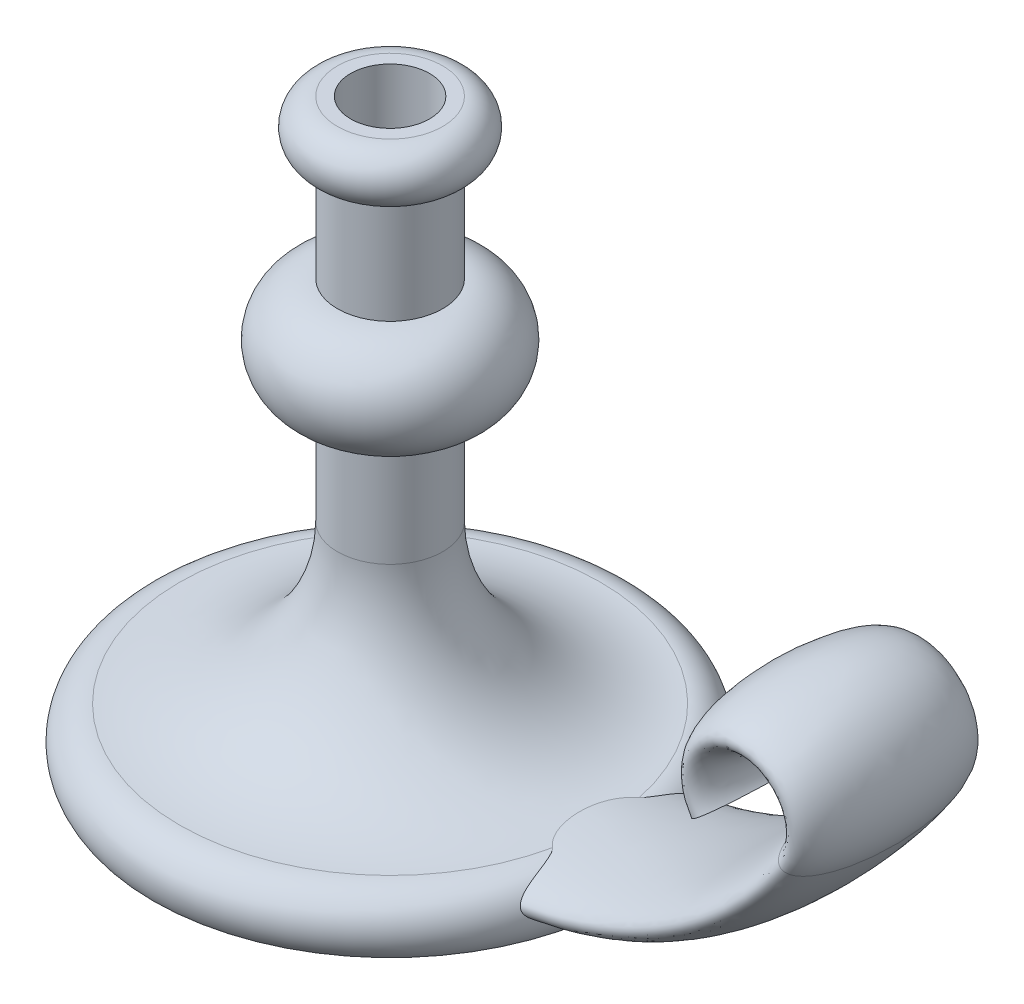
ISO-10303-21;
HEADER;
FILE_DESCRIPTION(('STEP AP214'),'2;1');
FILE_NAME('part.step','',(''),(''),'','','');
FILE_SCHEMA(('AUTOMOTIVE_DESIGN { 1 0 10303 214 1 1 1 1 }'));
ENDSEC;
DATA;
#1=APPLICATION_CONTEXT('core data for automotive mechanical design processes');
#2=APPLICATION_PROTOCOL_DEFINITION('international standard','automotive_design',2000,#1);
#3=PRODUCT_CONTEXT('',#1,'mechanical');
#4=PRODUCT('Part','Part','',(#3));
#5=PRODUCT_RELATED_PRODUCT_CATEGORY('part','',(#4));
#6=PRODUCT_DEFINITION_FORMATION('','',#4);
#7=PRODUCT_DEFINITION_CONTEXT('part definition',#1,'design');
#8=PRODUCT_DEFINITION('design','',#6,#7);
#9=PRODUCT_DEFINITION_SHAPE('','',#8);
#10=(LENGTH_UNIT() NAMED_UNIT(*) SI_UNIT(.MILLI.,.METRE.));
#11=(NAMED_UNIT(*) PLANE_ANGLE_UNIT() SI_UNIT($,.RADIAN.));
#12=(NAMED_UNIT(*) SI_UNIT($,.STERADIAN.) SOLID_ANGLE_UNIT());
#13=UNCERTAINTY_MEASURE_WITH_UNIT(LENGTH_MEASURE(1.E-05),#10,'distance_accuracy_value','');
#14=(GEOMETRIC_REPRESENTATION_CONTEXT(3) GLOBAL_UNCERTAINTY_ASSIGNED_CONTEXT((#13)) GLOBAL_UNIT_ASSIGNED_CONTEXT((#10,
#11,#12)) REPRESENTATION_CONTEXT('',''));
#15=CARTESIAN_POINT('',(0.,0.,0.));
#16=DIRECTION('',(0.,0.,1.));
#17=DIRECTION('',(1.,0.,0.));
#18=AXIS2_PLACEMENT_3D('',#15,#16,#17);
#19=CARTESIAN_POINT('',(0.,127.495412844037,0.));
#20=DIRECTION('',(0.,-1.,0.));
#21=DIRECTION('',(0.,0.,-1.));
#22=AXIS2_PLACEMENT_3D('',#19,#20,#21);
#23=PLANE('',#22);
#24=CARTESIAN_POINT('',(0.,127.495412844037,0.));
#25=DIRECTION('',(0.,1.,0.));
#26=DIRECTION('',(0.,0.,1.));
#27=AXIS2_PLACEMENT_3D('',#24,#25,#26);
#28=CIRCLE('',#27,15.);
#29=CARTESIAN_POINT('',(0.,127.495412844037,15.));
#30=VERTEX_POINT('',#29);
#31=EDGE_CURVE('E169',#30,#30,#28,.T.);
#32=ORIENTED_EDGE('',*,*,#31,.F.);
#33=EDGE_LOOP('',(#32));
#34=FACE_BOUND('',#33,.T.);
#35=CARTESIAN_POINT('',(0.,127.495412844037,0.));
#36=DIRECTION('',(0.,1.,0.));
#37=DIRECTION('',(0.,0.,1.));
#38=AXIS2_PLACEMENT_3D('',#35,#36,#37);
#39=CIRCLE('',#38,20.);
#40=CARTESIAN_POINT('',(0.,127.495412844037,20.));
#41=VERTEX_POINT('',#40);
#42=EDGE_CURVE('E69',#41,#41,#39,.T.);
#43=ORIENTED_EDGE('',*,*,#42,.T.);
#44=EDGE_LOOP('',(#43));
#45=FACE_BOUND('',#44,.T.);
#46=ADVANCED_FACE('F39',(#34,#45),#23,.F.);
#47=CARTESIAN_POINT('',(0.,-92.5045871559633,0.));
#48=DIRECTION('',(0.,1.,0.));
#49=DIRECTION('',(0.,0.,1.));
#50=AXIS2_PLACEMENT_3D('',#47,#48,#49);
#51=PLANE('',#50);
#52=CARTESIAN_POINT('',(0.,-92.5045871559633,0.));
#53=DIRECTION('',(0.,1.,0.));
#54=DIRECTION('',(0.,0.,1.));
#55=AXIS2_PLACEMENT_3D('',#52,#53,#54);
#56=CIRCLE('',#55,90.);
#57=CARTESIAN_POINT('',(0.,-92.5045871559633,90.));
#58=VERTEX_POINT('',#57);
#59=EDGE_CURVE('E53',#58,#58,#56,.T.);
#60=ORIENTED_EDGE('',*,*,#59,.F.);
#61=EDGE_LOOP('',(#60));
#62=FACE_BOUND('',#61,.T.);
#63=ADVANCED_FACE('F156',(#62),#51,.F.);
#64=CARTESIAN_POINT('',(0.,-85.0045871559633,0.));
#65=DIRECTION('',(0.,1.,0.));
#66=DIRECTION('',(0.,0.,1.));
#67=AXIS2_PLACEMENT_3D('',#64,#65,#66);
#68=TOROIDAL_SURFACE('',#67,80.0000000000001,12.5);
#69=CARTESIAN_POINT('',(0.,-72.5045871559634,0.));
#70=DIRECTION('',(0.,1.,0.));
#71=DIRECTION('',(0.,0.,1.));
#72=AXIS2_PLACEMENT_3D('',#69,#70,#71);
#73=CIRCLE('',#72,80.0000000000001);
#74=CARTESIAN_POINT('',(78.2712666342527,-72.5045871559634,-16.5411250968526));
#75=VERTEX_POINT('',#74);
#76=CARTESIAN_POINT('',(78.2712666342527,-72.5045871559633,16.5411250968526));
#77=VERTEX_POINT('',#76);
#78=EDGE_CURVE('E67',#75,#77,#73,.T.);
#79=ORIENTED_EDGE('',*,*,#78,.F.);
#80=CARTESIAN_POINT('',(78.2712666342527,-72.5045871559634,-16.5411250968528));
#81=CARTESIAN_POINT('',(78.3388892558145,-72.5045915093542,-16.5982789763076));
#82=CARTESIAN_POINT('',(78.4041967419212,-72.5053168747687,-16.658052603687));
#83=CARTESIAN_POINT('',(78.5301905551008,-72.5080437057157,-16.7815005380896));
#84=CARTESIAN_POINT('',(78.5909036085792,-72.5100370335412,-16.8451476466387));
#85=CARTESIAN_POINT('',(78.7084157352926,-72.5151314153452,-16.9755868199613));
#86=CARTESIAN_POINT('',(78.7652244379591,-72.5182296181446,-17.0423704092737));
#87=CARTESIAN_POINT('',(78.8754713552141,-72.5254114471429,-17.1785504647034));
#88=CARTESIAN_POINT('',(78.9289111406247,-72.5294946097344,-17.2479456886277));
#89=CARTESIAN_POINT('',(79.0321115032715,-72.5384856727747,-17.3879176791534));
#90=CARTESIAN_POINT('',(79.0819119096475,-72.5433817371829,-17.4584659850292));
#91=CARTESIAN_POINT('',(79.1789781802895,-72.5539641009125,-17.6013445037529));
#92=CARTESIAN_POINT('',(79.2262409589312,-72.5596513333858,-17.6736767365563));
#93=CARTESIAN_POINT('',(79.3184819734827,-72.5717535360463,-17.8198159167501));
#94=CARTESIAN_POINT('',(79.3634579992453,-72.5781691915992,-17.8936241982493));
#95=CARTESIAN_POINT('',(79.4513243361356,-72.5916739520405,-18.0424380596047));
#96=CARTESIAN_POINT('',(79.494214001074,-72.5987632635914,-18.1174440009669));
#97=CARTESIAN_POINT('',(79.5969639005976,-72.6169008060476,-18.3024023173175));
#98=CARTESIAN_POINT('',(79.6557814122336,-72.6282956005435,-18.4129004302327));
#99=CARTESIAN_POINT('',(79.7699561152132,-72.652306377049,-18.6355447229261));
#100=CARTESIAN_POINT('',(79.8253128778175,-72.6649225098742,-18.7476911047851));
#101=CARTESIAN_POINT('',(79.9868575610249,-72.7044878378632,-19.0861255774941));
#102=CARTESIAN_POINT('',(80.0885069377543,-72.7331516073427,-19.3143851937635));
#103=CARTESIAN_POINT('',(80.2823234076468,-72.794666408707,-19.7745296532846));
#104=CARTESIAN_POINT('',(80.3744817235505,-72.8275212547242,-20.0064176277774));
#105=CARTESIAN_POINT('',(80.5510014173376,-72.8971909714651,-20.4725897597494));
#106=CARTESIAN_POINT('',(80.6353613618328,-72.9340065675187,-20.7068743489863));
#107=CARTESIAN_POINT('',(80.7988648321056,-73.0121091962668,-21.1808226178135));
#108=CARTESIAN_POINT('',(80.8779027569703,-73.0534585723396,-21.4205122399656));
#109=CARTESIAN_POINT('',(81.0302064685401,-73.1400674466439,-21.9007816336799));
#110=CARTESIAN_POINT('',(81.1034770233062,-73.1853236486717,-22.1413604940642));
#111=CARTESIAN_POINT('',(81.245084590126,-73.2797924462324,-22.6230858246512));
#112=CARTESIAN_POINT('',(81.3134234622618,-73.3290035351418,-22.8642320450506));
#113=CARTESIAN_POINT('',(81.4458238857681,-73.4314781374148,-23.3468072083799));
#114=CARTESIAN_POINT('',(81.5098858231541,-73.4847412841283,-23.5882361237883));
#115=CARTESIAN_POINT('',(81.6739902059516,-73.63080179208,-24.2252806791802));
#116=CARTESIAN_POINT('',(81.7708857569272,-73.7271251131906,-24.6209063739885));
#117=CARTESIAN_POINT('',(81.9565801857021,-73.9318568212676,-25.4110697993072));
#118=CARTESIAN_POINT('',(82.0453762866304,-74.0402693248706,-25.8056071120463));
#119=CARTESIAN_POINT('',(82.2165010773454,-74.2703940534814,-26.5924524360119));
#120=CARTESIAN_POINT('',(82.2988262672455,-74.3921133917496,-26.9847591358134));
#121=CARTESIAN_POINT('',(82.4582025946178,-74.6499211224395,-27.7640097670044));
#122=CARTESIAN_POINT('',(82.5352725062751,-74.7859534127945,-28.1509683717236));
#123=CARTESIAN_POINT('',(82.6860711061443,-75.0748594050495,-28.9190701407598));
#124=CARTESIAN_POINT('',(82.7598013253312,-75.2277252775689,-29.3002159155246));
#125=CARTESIAN_POINT('',(82.8693425578225,-75.4718627823006,-29.8655437914771));
#126=CARTESIAN_POINT('',(82.9056681071528,-75.5556831811369,-30.0528569335828));
#127=CARTESIAN_POINT('',(82.9782782201637,-75.7287773077546,-30.424948369034));
#128=CARTESIAN_POINT('',(83.01456278664,-75.8180506373961,-30.6097268462419));
#129=CARTESIAN_POINT('',(83.0878356650458,-76.0036374146297,-30.9782160348205));
#130=CARTESIAN_POINT('',(83.1248273272171,-76.1000175296162,-31.1618926140779));
#131=CARTESIAN_POINT('',(83.1995540762818,-76.299666217612,-31.5253763426663));
#132=CARTESIAN_POINT('',(83.2372893138777,-76.4029361973399,-31.7051826918314));
#133=CARTESIAN_POINT('',(83.3140534809666,-76.617304704803,-32.0600551683962));
#134=CARTESIAN_POINT('',(83.3530836346586,-76.7284107592087,-32.2351165084858));
#135=CARTESIAN_POINT('',(83.4327849251538,-76.9586226280257,-32.5777969560054));
#136=CARTESIAN_POINT('',(83.4734433415735,-77.0776699716771,-32.7454580059901));
#137=CARTESIAN_POINT('',(83.5574066404026,-77.3255127934576,-33.0725591680993));
#138=CARTESIAN_POINT('',(83.6007094652056,-77.4543007106258,-33.2320054983626));
#139=CARTESIAN_POINT('',(83.6909243975622,-77.722883154956,-33.5399418459594));
#140=CARTESIAN_POINT('',(83.7378303017219,-77.8626587739595,-33.6884498686637));
#141=CARTESIAN_POINT('',(83.8124496637282,-78.0834995200816,-33.9019997501053));
#142=CARTESIAN_POINT('',(83.8383724448071,-78.1599688857172,-33.9724386291885));
#143=CARTESIAN_POINT('',(83.8916881128024,-78.3163650775124,-34.1088010547378));
#144=CARTESIAN_POINT('',(83.919080971809,-78.3962918380266,-34.1747246868735));
#145=CARTESIAN_POINT('',(83.9755475940192,-78.5597817473862,-34.3013061270112));
#146=CARTESIAN_POINT('',(84.0046227760621,-78.6433479505369,-34.3619593789756));
#147=CARTESIAN_POINT('',(84.0646175310657,-78.8140854809886,-34.4769964730707));
#148=CARTESIAN_POINT('',(84.0955371541358,-78.9012569062155,-34.5313801447535));
#149=CARTESIAN_POINT('',(84.1598279810826,-79.0803525767541,-34.6335257231657));
#150=CARTESIAN_POINT('',(84.1932276298659,-79.1723265422152,-34.681183323174));
#151=CARTESIAN_POINT('',(84.2621790731583,-79.359523994878,-34.7677396326691));
#152=CARTESIAN_POINT('',(84.2977301667913,-79.4547464194657,-34.806641175334));
#153=CARTESIAN_POINT('',(84.3709274331638,-79.6476861330435,-34.8744514195948));
#154=CARTESIAN_POINT('',(84.4085691399329,-79.7453978795024,-34.9033805380393));
#155=CARTESIAN_POINT('',(84.4858897292481,-79.9426247340496,-34.9503388268915));
#156=CARTESIAN_POINT('',(84.5255682091119,-80.0421394831753,-34.9683701429243));
#157=CARTESIAN_POINT('',(84.6022970376678,-80.2310279556876,-34.9915485155604));
#158=CARTESIAN_POINT('',(84.6391657268353,-80.3203310292361,-34.997880805206));
#159=CARTESIAN_POINT('',(84.7140458891139,-80.4986252705471,-35.0012194091044));
#160=CARTESIAN_POINT('',(84.7520572593239,-80.5876164655939,-34.9982265606315));
#161=CARTESIAN_POINT('',(84.828939751449,-80.7645113433256,-34.9830935336921));
#162=CARTESIAN_POINT('',(84.8678114880931,-80.8524141735395,-34.9709465954878));
#163=CARTESIAN_POINT('',(84.946069114117,-81.0263395954697,-34.9379800584416));
#164=CARTESIAN_POINT('',(84.9854550697223,-81.1123619411083,-34.9171593316254));
#165=CARTESIAN_POINT('',(85.0697921876547,-81.2934408710784,-34.8641753280259));
#166=CARTESIAN_POINT('',(85.1147749779847,-81.388144099751,-34.8308581676941));
#167=CARTESIAN_POINT('',(85.2046838445247,-81.5739050292824,-34.7550998186569));
#168=CARTESIAN_POINT('',(85.2496098599892,-81.6649601634005,-34.7126523352378));
#169=CARTESIAN_POINT('',(85.339175816421,-81.8432389012871,-34.6197961730878));
#170=CARTESIAN_POINT('',(85.3838152384236,-81.9304566626695,-34.5693758577485));
#171=CARTESIAN_POINT('',(85.4725433576223,-82.1008448335008,-34.4617763413088));
#172=CARTESIAN_POINT('',(85.5166321604852,-82.1840160286621,-34.4045984597628));
#173=CARTESIAN_POINT('',(85.6333169412866,-82.4005453206436,-34.244469560309));
#174=CARTESIAN_POINT('',(85.7053409594005,-82.5304330306689,-34.1363971219682));
#175=CARTESIAN_POINT('',(85.8473354366557,-82.7802199016686,-33.9080434887014));
#176=CARTESIAN_POINT('',(85.9173043345906,-82.9001115899402,-33.7877533065824));
#177=CARTESIAN_POINT('',(86.0552514115732,-83.1311555673389,-33.5375399276813));
#178=CARTESIAN_POINT('',(86.1232253856288,-83.2422901268753,-33.4075981732872));
#179=CARTESIAN_POINT('',(86.2570712449221,-83.4565724101324,-33.1403753989454));
#180=CARTESIAN_POINT('',(86.3229435933944,-83.5597219011507,-33.0030960144367));
#181=CARTESIAN_POINT('',(86.4763788941153,-83.7953824900399,-32.6715062554627));
#182=CARTESIAN_POINT('',(86.5630874342175,-83.9248760734404,-32.4746614819152));
#183=CARTESIAN_POINT('',(86.7330832925744,-84.1728436431145,-32.0727308970354));
#184=CARTESIAN_POINT('',(86.8163697044984,-84.2913147205123,-31.8676429306305));
#185=CARTESIAN_POINT('',(86.9796904219906,-84.518715303965,-31.4512592814513));
#186=CARTESIAN_POINT('',(87.0597273222975,-84.6276525064879,-31.2399687933359));
#187=CARTESIAN_POINT('',(87.2168302910954,-84.8373543468842,-30.8123475780938));
#188=CARTESIAN_POINT('',(87.293896702849,-84.9381199305446,-30.5960174380004));
#189=CARTESIAN_POINT('',(87.4378225440259,-85.1229695997437,-30.1806848657601));
#190=CARTESIAN_POINT('',(87.5049410945413,-85.2077200798215,-29.9820671531093));
#191=CARTESIAN_POINT('',(87.6370407139698,-85.3720325311893,-29.5819890870767));
#192=CARTESIAN_POINT('',(87.7020216504215,-85.4515941812426,-29.3805285586355));
#193=CARTESIAN_POINT('',(87.8940146299795,-85.6834142385497,-28.7721902007842));
#194=CARTESIAN_POINT('',(88.0179695510851,-85.828671255617,-28.3616675742864));
#195=CARTESIAN_POINT('',(88.2584605699698,-86.1038591464786,-27.5329675534004));
#196=CARTESIAN_POINT('',(88.3749891793348,-86.2337746596144,-27.1147829632503));
#197=CARTESIAN_POINT('',(88.600989519775,-86.480481294962,-26.2726296503248));
#198=CARTESIAN_POINT('',(88.7104602849534,-86.5972706224164,-25.8486601454376));
#199=CARTESIAN_POINT('',(88.9231766254771,-86.81999648634,-24.9941437828416));
#200=CARTESIAN_POINT('',(89.0263911874531,-86.925880527958,-24.5635756179251));
#201=CARTESIAN_POINT('',(89.2262514874914,-87.1274962239961,-23.6989379380732));
#202=CARTESIAN_POINT('',(89.3229022580088,-87.2232356885456,-23.2648713976422));
#203=CARTESIAN_POINT('',(89.509917597226,-87.4057273580284,-22.3936656206205));
#204=CARTESIAN_POINT('',(89.6002841603527,-87.4924824186691,-21.9565274078334));
#205=CARTESIAN_POINT('',(89.7749397613539,-87.6579137132052,-21.0795461515422));
#206=CARTESIAN_POINT('',(89.8592290377276,-87.736590264188,-20.6397032149194));
#207=CARTESIAN_POINT('',(90.0784540022308,-87.9387720783773,-19.450925968302));
#208=CARTESIAN_POINT('',(90.2078402059729,-88.0553966849146,-18.6997869704262));
#209=CARTESIAN_POINT('',(90.4501688975195,-88.2702799598216,-17.1920835371157));
#210=CARTESIAN_POINT('',(90.5631070077539,-88.3685337408643,-16.4355177133709));
#211=CARTESIAN_POINT('',(90.7729175657185,-88.5486210437708,-14.9181631266858));
#212=CARTESIAN_POINT('',(90.8697887084979,-88.6304532319947,-14.1573740259143));
#213=CARTESIAN_POINT('',(91.0476600422211,-88.7790831116271,-12.6333724812456));
#214=CARTESIAN_POINT('',(91.1286780495765,-88.8458976931522,-11.8701637487476));
#215=CARTESIAN_POINT('',(91.2752034380212,-88.9657068944919,-10.3412630985364));
#216=CARTESIAN_POINT('',(91.3407124466643,-89.0187029645155,-9.57557144994316));
#217=CARTESIAN_POINT('',(91.4564034311203,-89.1116954789613,-8.04224330721161));
#218=CARTESIAN_POINT('',(91.5065851081945,-89.1516916700092,-7.27460677546038));
#219=CARTESIAN_POINT('',(91.6137884516635,-89.2367727420307,-5.34025126960139));
#220=CARTESIAN_POINT('',(91.6609082979045,-89.2737777388727,-4.17260733338274));
#221=CARTESIAN_POINT('',(91.7204104482808,-89.3204378939909,-1.83556498533103));
#222=CARTESIAN_POINT('',(91.732782130954,-89.3300846897017,-0.666166146340098));
#223=CARTESIAN_POINT('',(91.7228215364271,-89.3222984303315,1.67293648508414));
#224=CARTESIAN_POINT('',(91.700473472454,-89.3048530566734,2.84264017430961));
#225=CARTESIAN_POINT('',(91.620900405131,-89.2422929486805,5.18084223253035));
#226=CARTESIAN_POINT('',(91.5636538448674,-89.1971611122197,6.3493394090248));
#227=CARTESIAN_POINT('',(91.4140167246973,-89.0778111914177,8.68152701221707));
#228=CARTESIAN_POINT('',(91.3216599843586,-89.0036210951097,9.84522097858417));
#229=CARTESIAN_POINT('',(91.1563678196139,-88.8685698059778,11.5861868730805));
#230=CARTESIAN_POINT('',(91.0968173404245,-88.8195970410688,12.1656955271914));
#231=CARTESIAN_POINT('',(90.9686956054545,-88.7132511136595,13.322936849525));
#232=CARTESIAN_POINT('',(90.9001246131908,-88.655878196548,13.900669569124));
#233=CARTESIAN_POINT('',(90.7539010796994,-88.5322121212766,15.0535567004511));
#234=CARTESIAN_POINT('',(90.6762558116164,-88.4659261007497,15.628712798593));
#235=CARTESIAN_POINT('',(90.5116951221848,-88.323687130915,16.7764820322725));
#236=CARTESIAN_POINT('',(90.4247800512052,-88.2477345469515,17.3490952630708));
#237=CARTESIAN_POINT('',(90.2415668389074,-88.08533423267,18.4908572097234));
#238=CARTESIAN_POINT('',(90.1452762010122,-87.9988948816764,19.0600083149961));
#239=CARTESIAN_POINT('',(89.9430294433435,-87.8143564483394,20.1946711952416));
#240=CARTESIAN_POINT('',(89.837073825655,-87.7162579715944,20.7601831576318));
#241=CARTESIAN_POINT('',(89.6049324425339,-87.4972836002907,21.9389717087278));
#242=CARTESIAN_POINT('',(89.4777819357749,-87.3751398865665,22.5518246264387));
#243=CARTESIAN_POINT('',(89.2110751860371,-87.1127723272791,23.7710436137378));
#244=CARTESIAN_POINT('',(89.0715179425442,-86.9725470231542,24.3774091557403));
#245=CARTESIAN_POINT('',(88.8525167674592,-86.7462609749981,25.2799559859351));
#246=CARTESIAN_POINT('',(88.7779794096615,-86.6682543430043,25.5793623583899));
#247=CARTESIAN_POINT('',(88.6255344766266,-86.5063383386887,26.175705969143));
#248=CARTESIAN_POINT('',(88.5476270421581,-86.4224292128239,26.4726433099568));
#249=CARTESIAN_POINT('',(88.3883274092053,-86.2480781611546,27.0635774677472));
#250=CARTESIAN_POINT('',(88.3069360276867,-86.1576377635156,27.3575749543713));
#251=CARTESIAN_POINT('',(88.1404964504915,-85.9694165963176,27.9421520258321));
#252=CARTESIAN_POINT('',(88.0554485100522,-85.871636338746,28.2327318474334));
#253=CARTESIAN_POINT('',(87.8815058371697,-85.6677607858246,28.8097639467423));
#254=CARTESIAN_POINT('',(87.7926115972529,-85.561666553693,29.0962167466982));
#255=CARTESIAN_POINT('',(87.6107173984291,-85.3399114843373,29.6641211347994));
#256=CARTESIAN_POINT('',(87.5177171579848,-85.2242499906353,29.9455723781398));
#257=CARTESIAN_POINT('',(87.3272005054265,-84.9816455767455,30.5024911924709));
#258=CARTESIAN_POINT('',(87.2296787050247,-84.8546890218234,30.7779510180563));
#259=CARTESIAN_POINT('',(87.0298665207525,-84.5875929875035,31.3206199653102));
#260=CARTESIAN_POINT('',(86.9275773438899,-84.4474568358777,31.5878311472014));
#261=CARTESIAN_POINT('',(86.7480037709054,-84.1939614907395,32.0357516545311));
#262=CARTESIAN_POINT('',(86.6720100993081,-84.08452643568,32.2191943871446));
#263=CARTESIAN_POINT('',(86.5171484093753,-83.8562894413848,32.5790337639054));
#264=CARTESIAN_POINT('',(86.438279647711,-83.7374850704267,32.7554285608074));
#265=CARTESIAN_POINT('',(86.2776918897527,-83.4893208968004,33.0985853512337));
#266=CARTESIAN_POINT('',(86.1959802836668,-83.3599874399396,33.2653697066044));
#267=CARTESIAN_POINT('',(86.029403279259,-83.0887688342979,33.5866682820135));
#268=CARTESIAN_POINT('',(85.9445404155118,-82.946893651306,33.7411920624098));
#269=CARTESIAN_POINT('',(85.8138131522192,-82.7213529135695,33.9622058802819));
#270=CARTESIAN_POINT('',(85.7691199179077,-82.6430546604312,34.0348677373651));
#271=CARTESIAN_POINT('',(85.6789309129748,-82.4823829740211,34.1749890546346));
#272=CARTESIAN_POINT('',(85.6334350204786,-82.4000089183975,34.2424477162736));
#273=CARTESIAN_POINT('',(85.4958500686676,-82.1464406597793,34.4355562095002));
#274=CARTESIAN_POINT('',(85.4025439564439,-81.9685955600294,34.552145622907));
#275=CARTESIAN_POINT('',(85.2695591143314,-81.7049133851304,34.6925857046313));
#276=CARTESIAN_POINT('',(85.2304987424132,-81.6262372928431,34.7307425297912));
#277=CARTESIAN_POINT('',(85.1522731182963,-81.4660424983367,34.8003600398766));
#278=CARTESIAN_POINT('',(85.1131079273793,-81.3845252183201,34.8318240205415));
#279=CARTESIAN_POINT('',(85.0349200797642,-81.2190026755068,34.8872431666278));
#280=CARTESIAN_POINT('',(84.9958973213632,-81.1349999145293,34.9112056191362));
#281=CARTESIAN_POINT('',(84.9182225111749,-80.9648958932546,34.9509382938014));
#282=CARTESIAN_POINT('',(84.8795704509228,-80.8787946810347,34.9667087034603));
#283=CARTESIAN_POINT('',(84.8026293496201,-80.7044306866587,34.9895843289455));
#284=CARTESIAN_POINT('',(84.7643457794923,-80.6161560491491,34.9966183715658));
#285=CARTESIAN_POINT('',(84.6887815628096,-80.4389227189463,35.0014664065664));
#286=CARTESIAN_POINT('',(84.6515009117287,-80.3499640293426,34.9992804405626));
#287=CARTESIAN_POINT('',(84.5782193926512,-80.1721935782249,34.9856865880064));
#288=CARTESIAN_POINT('',(84.5422189587605,-80.0833818761045,34.974275603913));
#289=CARTESIAN_POINT('',(84.4717363396369,-79.9067631125583,34.9425495638958));
#290=CARTESIAN_POINT('',(84.4372541317288,-79.8189560361425,34.9222346410053));
#291=CARTESIAN_POINT('',(84.3738146765022,-79.6550469679531,34.8761014182744));
#292=CARTESIAN_POINT('',(84.3446776376699,-79.5787585569988,34.8511827714304));
#293=CARTESIAN_POINT('',(84.2877340669062,-79.4278861718098,34.7953503080139));
#294=CARTESIAN_POINT('',(84.2599279900084,-79.3533027849831,34.7644344590942));
#295=CARTESIAN_POINT('',(84.1785257465461,-79.1326034822472,34.663562521018));
#296=CARTESIAN_POINT('',(84.1269059556145,-78.9894353091325,34.585451784547));
#297=CARTESIAN_POINT('',(84.0338718768018,-78.7271996809849,34.4214962686608));
#298=CARTESIAN_POINT('',(83.9919569862798,-78.607195569091,34.3373844016424));
#299=CARTESIAN_POINT('',(83.9114605781051,-78.3743150962164,34.1582754261179));
#300=CARTESIAN_POINT('',(83.8728814982954,-78.2614439640308,34.0632704728257));
#301=CARTESIAN_POINT('',(83.7984371134397,-78.0422440177544,33.8643728706812));
#302=CARTESIAN_POINT('',(83.7625808160949,-77.9359371196283,33.7604529539227));
#303=CARTESIAN_POINT('',(83.693213014137,-77.7297640718422,33.5457714872258));
#304=CARTESIAN_POINT('',(83.6597009944741,-77.6298965078073,33.435011450229));
#305=CARTESIAN_POINT('',(83.5720737063515,-77.369124948329,33.1296793792453));
#306=CARTESIAN_POINT('',(83.5196901207786,-77.2136313599906,32.9299906787272));
#307=CARTESIAN_POINT('',(83.4184271933206,-76.9166838781291,32.5192921244371));
#308=CARTESIAN_POINT('',(83.3695532962444,-76.7752516736237,32.3082655316773));
#309=CARTESIAN_POINT('',(83.2740150847622,-76.504486352872,31.8779341174122));
#310=CARTESIAN_POINT('',(83.2273524189498,-76.3751621958674,31.658623331881));
#311=CARTESIAN_POINT('',(83.1350217384245,-76.1264451936712,31.2127839021377));
#312=CARTESIAN_POINT('',(83.0893599129077,-76.0071056171389,30.9862244820573));
#313=CARTESIAN_POINT('',(82.998509313002,-75.7778485384007,30.5285934080423));
#314=CARTESIAN_POINT('',(82.9533201339367,-75.6679222764563,30.2975262003254));
#315=CARTESIAN_POINT('',(82.8627395348186,-75.4563276507073,29.8317799322432));
#316=CARTESIAN_POINT('',(82.8173481770993,-75.3546569055428,29.5971019368344));
#317=CARTESIAN_POINT('',(82.7223694680925,-75.1512969342302,29.1070665122634));
#318=CARTESIAN_POINT('',(82.6727235102117,-75.0501826749849,28.8514824484477));
#319=CARTESIAN_POINT('',(82.5719932470383,-74.855594875399,28.3376892073985));
#320=CARTESIAN_POINT('',(82.5209088281037,-74.7621219410319,28.0794798237937));
#321=CARTESIAN_POINT('',(82.4167546708106,-74.5820472118822,27.5608047979117));
#322=CARTESIAN_POINT('',(82.3636831771415,-74.4954517136596,27.3003373247882));
#323=CARTESIAN_POINT('',(82.2551248640217,-74.3286633500368,26.7778584219808));
#324=CARTESIAN_POINT('',(82.1996379286368,-74.248470792484,26.5158469187109));
#325=CARTESIAN_POINT('',(82.0287444819474,-74.0166041114553,25.7275251903661));
#326=CARTESIAN_POINT('',(81.9090155015303,-73.8738327507938,25.1994881187896));
#327=CARTESIAN_POINT('',(81.7178869198205,-73.6755220972162,24.4065351193836));
#328=CARTESIAN_POINT('',(81.6522771425473,-73.6120769372984,24.1421505190693));
#329=CARTESIAN_POINT('',(81.5166076742085,-73.490223601724,23.6133651940213));
#330=CARTESIAN_POINT('',(81.4465482003172,-73.4318151805692,23.3489644707027));
#331=CARTESIAN_POINT('',(81.301365411033,-73.319912588746,22.8208046783146));
#332=CARTESIAN_POINT('',(81.2262471637668,-73.2664136228916,22.5570452334603));
#333=CARTESIAN_POINT('',(81.0700468637341,-73.1641618752452,22.030385407007));
#334=CARTESIAN_POINT('',(80.9889652271183,-73.1154087628182,21.7674849667977));
#335=CARTESIAN_POINT('',(80.8198637173837,-73.0226712077422,21.2434494704707));
#336=CARTESIAN_POINT('',(80.7318528008745,-72.9786807782375,20.9823125941556));
#337=CARTESIAN_POINT('',(80.5473975922248,-72.8954623018397,20.4622889135825));
#338=CARTESIAN_POINT('',(80.4509548697555,-72.8562333717762,20.2034017003492));
#339=CARTESIAN_POINT('',(80.2946063541766,-72.7997113534789,19.8078680281103));
#340=CARTESIAN_POINT('',(80.2384058452969,-72.7806571473535,19.6700047638825));
#341=CARTESIAN_POINT('',(80.1225595817104,-72.7440362378771,19.3955133449492));
#342=CARTESIAN_POINT('',(80.0629135393479,-72.7264696590258,19.258885294472));
#343=CARTESIAN_POINT('',(79.939662780107,-72.6928968084471,18.9871768910579));
#344=CARTESIAN_POINT('',(79.8760569065128,-72.6768909961763,18.8520970041327));
#345=CARTESIAN_POINT('',(79.7448416675377,-72.6466843497069,18.5851486304856));
#346=CARTESIAN_POINT('',(79.6772718573024,-72.6324690504427,18.4532624439135));
#347=CARTESIAN_POINT('',(79.5368706995462,-72.6058318712923,18.1921539855722));
#348=CARTESIAN_POINT('',(79.4640403013482,-72.5934096690319,18.0629312385432));
#349=CARTESIAN_POINT('',(79.3121236957276,-72.5705618742519,17.8080304784761));
#350=CARTESIAN_POINT('',(79.233039014523,-72.5601357967342,17.6823516107264));
#351=CARTESIAN_POINT('',(79.1086379396564,-72.5462006455834,17.4973179691225));
#352=CARTESIAN_POINT('',(79.0661382218065,-72.5418341522067,17.4361287744194));
#353=CARTESIAN_POINT('',(78.9790570421029,-72.5337277039108,17.3152324301589));
#354=CARTESIAN_POINT('',(78.9344762865225,-72.5299875383739,17.2555247881704));
#355=CARTESIAN_POINT('',(78.8430399487911,-72.5231916069412,17.1378979454431));
#356=CARTESIAN_POINT('',(78.7961859715392,-72.5201353665079,17.0799775288549));
#357=CARTESIAN_POINT('',(78.6994379587826,-72.5147445726254,16.9656484478461));
#358=CARTESIAN_POINT('',(78.6495173103043,-72.5124178796712,16.9092618547308));
#359=CARTESIAN_POINT('',(78.5467910507281,-72.5086112187733,16.7990552318002));
#360=CARTESIAN_POINT('',(78.4939834218552,-72.5071318515512,16.7452370476067));
#361=CARTESIAN_POINT('',(78.3851077252436,-72.5051195720693,16.6406716194586));
#362=CARTESIAN_POINT('',(78.3290306694287,-72.5045894095085,16.5899337074125));
#363=CARTESIAN_POINT('',(78.2712666342527,-72.5045871559633,16.5411250968527));
#364=B_SPLINE_CURVE_WITH_KNOTS('',3,(#80,#81,#82,#83,#84,#85,#86,#87,#88,#89,#90,#91,#92,#93,
#94,#95,#96,#97,#98,#99,#100,#101,#102,#103,#104,#105,#106,#107,#108,#109,#110,#111,#112,#113,
#114,#115,#116,#117,#118,#119,#120,#121,#122,#123,#124,#125,#126,#127,#128,#129,#130,#131,#132,
#133,#134,#135,#136,#137,#138,#139,#140,#141,#142,#143,#144,#145,#146,#147,#148,#149,#150,#151,
#152,#153,#154,#155,#156,#157,#158,#159,#160,#161,#162,#163,#164,#165,#166,#167,#168,#169,#170,
#171,#172,#173,#174,#175,#176,#177,#178,#179,#180,#181,#182,#183,#184,#185,#186,#187,#188,#189,
#190,#191,#192,#193,#194,#195,#196,#197,#198,#199,#200,#201,#202,#203,#204,#205,#206,#207,#208,
#209,#210,#211,#212,#213,#214,#215,#216,#217,#218,#219,#220,#221,#222,#223,#224,#225,#226,#227,
#228,#229,#230,#231,#232,#233,#234,#235,#236,#237,#238,#239,#240,#241,#242,#243,#244,#245,#246,
#247,#248,#249,#250,#251,#252,#253,#254,#255,#256,#257,#258,#259,#260,#261,#262,#263,#264,#265,
#266,#267,#268,#269,#270,#271,#272,#273,#274,#275,#276,#277,#278,#279,#280,#281,#282,#283,#284,
#285,#286,#287,#288,#289,#290,#291,#292,#293,#294,#295,#296,#297,#298,#299,#300,#301,#302,#303,
#304,#305,#306,#307,#308,#309,#310,#311,#312,#313,#314,#315,#316,#317,#318,#319,#320,#321,#322,
#323,#324,#325,#326,#327,#328,#329,#330,#331,#332,#333,#334,#335,#336,#337,#338,#339,#340,#341,
#342,#343,#344,#345,#346,#347,#348,#349,#350,#351,#352,#353,#354,#355,#356,#357,#358,#359,#360,
#361,#362,#363),.UNSPECIFIED.,.F.,.F.,(4,2,2,2,2,2,2,2,2,2,2,2,2,2,2,2,2,2,2,2,2,2,2,2,2,2,2,2,
2,2,2,2,2,2,2,2,2,2,2,2,2,2,2,2,2,2,2,2,2,2,2,2,2,2,2,2,2,2,2,2,2,2,2,2,2,2,2,2,2,2,2,2,2,2,2,2,
2,2,2,2,2,2,2,2,2,2,2,2,2,2,2,2,2,2,2,2,2,2,2,2,2,2,2,2,2,2,2,2,2,2,2,2,2,2,2,2,2,2,2,2,2,2,2,2,
2,2,2,2,2,2,2,2,2,2,2,2,2,2,2,2,2,4),(0.,0.265437731793733,0.529188855373285,0.792264224758114,
1.05521600884629,1.31462977977646,1.57435215499751,1.83432095765846,2.09436977197639,
2.47137225494424,2.84842135117269,3.60260099941518,4.35747195968137,5.1124813950865,
5.87962264534391,6.64612286574213,7.41233245776683,8.17847280166093,9.43385283168315,
10.689661659626,11.9461451019857,13.1978751032555,14.4490253583387,15.0741636567068,
15.6992563657032,16.3312285637779,16.9633301902022,17.5960474533326,18.2245331925293,
18.8525359903658,19.4794808031528,19.8008015225351,20.1221161436916,20.4437058213707,
20.7653042398908,21.0914422359282,21.4174745520315,21.7428353517027,22.068132071494,
22.3581500476251,22.6481419847193,22.9383482732824,23.2285923132226,23.5581258315206,
23.8878872723204,24.218134530301,24.5483174069042,25.0984226776905,25.6489355694044,
26.2005358211627,26.7520136386951,27.5046897085668,28.2575638520526,29.0098245014552,
29.7619979592106,30.4403026934178,31.1186493812164,32.4764125471967,33.8355238474612,
35.1948207549606,36.5603819093716,37.9248839847262,39.288951011069,40.6529644763159,
42.9656827694935,45.2790154595638,47.592535945415,49.9034412765006,52.214103987703,
54.5248117322083,58.031441272654,61.5391425670381,65.0484392501716,68.5599058367513,
72.0679985697248,73.8217362689797,75.5754227475334,77.3277131420698,79.0799373290809,
80.8307705315048,82.5815128318288,84.4942984218767,86.4072384044917,87.3619313941869,
88.3165845445848,89.2710150475971,90.2253790366532,91.1796211770609,92.1339288492233,
93.0894045549114,94.0446396529052,94.7245467110672,95.4046308174937,96.0830626506225,
96.7609601588704,97.108154558043,97.4554021364149,98.1489578844982,98.4360519055228,
98.7230042246514,99.0096769231476,99.296343059899,99.5853295997084,99.8743148351313,
100.163397145223,100.452475136298,100.708363160318,100.964338052292,101.475947411664,
101.932583056361,102.389549642996,102.847967494709,103.306284311279,104.080711930252,
104.856316115109,105.632489739236,106.412570428746,107.191917126823,107.971038212482,
108.808820810776,109.646669782696,110.485277200954,111.323924914427,113.003025857044,
113.842052915256,114.681039054895,115.519196814396,116.357296139082,117.194329403298,
118.03120717524,118.481443832928,118.931718133785,119.382124588176,119.828620401921,
120.275035841624,120.7213426778,120.945190845251,121.168963586584,121.392580579778,
121.618530133625,121.844639679427,122.071403176284),.UNSPECIFIED.);
#365=EDGE_CURVE('E59',#75,#77,#364,.T.);
#366=ORIENTED_EDGE('',*,*,#365,.T.);
#367=EDGE_LOOP('',(#79,#366));
#368=FACE_BOUND('',#367,.T.);
#369=ORIENTED_EDGE('',*,*,#59,.T.);
#370=EDGE_LOOP('',(#369));
#371=FACE_BOUND('',#370,.T.);
#372=ADVANCED_FACE('F65',(#368,#371),#68,.T.);
#373=CARTESIAN_POINT('',(0.,-12.5045871559633,0.));
#374=DIRECTION('',(0.,1.,0.));
#375=DIRECTION('',(0.,0.,1.));
#376=AXIS2_PLACEMENT_3D('',#373,#374,#375);
#377=TOROIDAL_SURFACE('',#376,80.,60.);
#378=CARTESIAN_POINT('',(0.,-12.5045871559633,0.));
#379=DIRECTION('',(0.,1.,0.));
#380=DIRECTION('',(0.,0.,1.));
#381=AXIS2_PLACEMENT_3D('',#378,#379,#380);
#382=CIRCLE('',#381,20.);
#383=CARTESIAN_POINT('',(0.,-12.5045871559633,20.));
#384=VERTEX_POINT('',#383);
#385=EDGE_CURVE('E74',#384,#384,#382,.T.);
#386=ORIENTED_EDGE('',*,*,#385,.F.);
#387=EDGE_LOOP('',(#386));
#388=FACE_BOUND('',#387,.T.);
#389=ORIENTED_EDGE('',*,*,#78,.T.);
#390=CARTESIAN_POINT('',(78.2712666342527,-72.5045871559633,16.5411250968526));
#391=CARTESIAN_POINT('',(78.1557789795164,-72.5045875491456,16.4435856404802));
#392=CARTESIAN_POINT('',(78.0418151270569,-72.5041438004372,16.3442572860744));
#393=CARTESIAN_POINT('',(77.8170462655204,-72.5024202117152,16.142097222431));
#394=CARTESIAN_POINT('',(77.7062412347084,-72.5011403774558,16.0392655373094));
#395=CARTESIAN_POINT('',(77.3790439261404,-72.4961298487924,15.7259268001447));
#396=CARTESIAN_POINT('',(77.1675355315799,-72.4912278251577,15.5102941448351));
#397=CARTESIAN_POINT('',(76.7585172282386,-72.478762639411,15.0664355779378));
#398=CARTESIAN_POINT('',(76.56100072205,-72.4712007416439,14.8382156929483));
#399=CARTESIAN_POINT('',(76.1833700343549,-72.454043607888,14.3738832179981));
#400=CARTESIAN_POINT('',(76.0030294168178,-72.4444825469291,14.13795337358));
#401=CARTESIAN_POINT('',(75.6564526280381,-72.4237296589157,13.6559364552629));
#402=CARTESIAN_POINT('',(75.4902203466266,-72.4125373844131,13.4098466077542));
#403=CARTESIAN_POINT('',(75.171863421937,-72.3889847699146,12.9087383218308));
#404=CARTESIAN_POINT('',(75.0197406513476,-72.3766242753047,12.6537187043798));
#405=CARTESIAN_POINT('',(74.6914401014405,-72.3478464308838,12.0683107387159));
#406=CARTESIAN_POINT('',(74.519356345459,-72.3312126678164,11.7356333884665));
#407=CARTESIAN_POINT('',(74.1963370159274,-72.2975603868571,11.0601358457905));
#408=CARTESIAN_POINT('',(74.0454070234178,-72.2805417687983,10.7173130054445));
#409=CARTESIAN_POINT('',(73.7635413603112,-72.246786404245,10.0235361379255));
#410=CARTESIAN_POINT('',(73.6326070932905,-72.2300496776108,9.6725815419431));
#411=CARTESIAN_POINT('',(73.388548234846,-72.1972870965397,8.96167015356552));
#412=CARTESIAN_POINT('',(73.2755602886472,-72.1812673067647,8.601666415052));
#413=CARTESIAN_POINT('',(73.06721274904,-72.1505182845725,7.87661755090259));
#414=CARTESIAN_POINT('',(72.9718506905344,-72.1357888718394,7.51157313792481));
#415=CARTESIAN_POINT('',(72.7974631596101,-72.1079636976479,6.77753668968467));
#416=CARTESIAN_POINT('',(72.7184392509929,-72.0948680926166,6.40854428009265));
#417=CARTESIAN_POINT('',(72.5344393568382,-72.0635887259884,5.45415883695004));
#418=CARTESIAN_POINT('',(72.4407290898189,-72.0468183605357,4.86652865534717));
#419=CARTESIAN_POINT('',(72.2874435492266,-72.0187297573767,3.68652633317677));
#420=CARTESIAN_POINT('',(72.2278843890285,-72.0074140937401,3.09415208767087));
#421=CARTESIAN_POINT('',(72.1405890357684,-71.9906459048657,1.90674304677121));
#422=CARTESIAN_POINT('',(72.1128666694614,-71.9851959271663,1.31170720798185));
#423=CARTESIAN_POINT('',(72.0881810312592,-71.9803487503232,0.121344490184132));
#424=CARTESIAN_POINT('',(72.0911991892243,-71.9809478969431,-0.473981995899478));
#425=CARTESIAN_POINT('',(72.1280638943857,-71.9881690059384,-1.66338765987726));
#426=CARTESIAN_POINT('',(72.1618965804529,-71.99478826032,-2.25746727822353));
#427=CARTESIAN_POINT('',(72.2617097911531,-72.0138238026477,-3.44262588331824));
#428=CARTESIAN_POINT('',(72.3276772093179,-72.0262377270942,-4.03370599422079));
#429=CARTESIAN_POINT('',(72.4900060604309,-72.0556151091227,-5.18020489557862));
#430=CARTESIAN_POINT('',(72.5846056731637,-72.0723079603619,-5.73587774296233));
#431=CARTESIAN_POINT('',(72.8082207261423,-72.1098322518058,-6.84021274784503));
#432=CARTESIAN_POINT('',(72.9372362918328,-72.1306637070954,-7.38887487978259));
#433=CARTESIAN_POINT('',(73.2333153089358,-72.1754019682793,-8.47433677262692));
#434=CARTESIAN_POINT('',(73.4002834292264,-72.1993010044857,-9.01116261997214));
#435=CARTESIAN_POINT('',(73.7769328071219,-72.2487572659389,-10.0696211353561));
#436=CARTESIAN_POINT('',(73.986600028196,-72.2743139443899,-10.5912587320046));
#437=CARTESIAN_POINT('',(74.3396558422203,-72.3127266467053,-11.3650666682906));
#438=CARTESIAN_POINT('',(74.46583154197,-72.3257274738534,-11.6251590322935));
#439=CARTESIAN_POINT('',(74.731088615336,-72.3512824885711,-12.1387235937978));
#440=CARTESIAN_POINT('',(74.8701695272698,-72.3638366920963,-12.392196027711));
#441=CARTESIAN_POINT('',(75.1615985760865,-72.3881238267203,-12.8914851424527));
#442=CARTESIAN_POINT('',(75.3139481934799,-72.3998566659079,-13.1373009647981));
#443=CARTESIAN_POINT('',(75.6317755416185,-72.4220676352619,-13.6196920526048));
#444=CARTESIAN_POINT('',(75.7972274485162,-72.4325481361789,-13.856284187785));
#445=CARTESIAN_POINT('',(76.1414599201795,-72.4518502837583,-14.3196080183237));
#446=CARTESIAN_POINT('',(76.3202392579901,-72.4606720828619,-14.546340618339));
#447=CARTESIAN_POINT('',(76.6907824173524,-72.4762171504514,-14.988813166453));
#448=CARTESIAN_POINT('',(76.8825382502212,-72.4829416960152,-15.2045597370202));
#449=CARTESIAN_POINT('',(77.1743689073127,-72.4909976670076,-15.5138101516904));
#450=CARTESIAN_POINT('',(77.2695948961593,-72.4933050658138,-15.6119038715623));
#451=CARTESIAN_POINT('',(77.4627749952647,-72.4973116916418,-15.8053429384357));
#452=CARTESIAN_POINT('',(77.5607285388772,-72.4990110439833,-15.9006888480384));
#453=CARTESIAN_POINT('',(77.8585420580578,-72.5031362949798,-16.1824855130868));
#454=CARTESIAN_POINT('',(78.0623994423907,-72.504590653433,-16.3647423728695));
#455=CARTESIAN_POINT('',(78.2712666342528,-72.5045871559633,-16.5411250968525));
#456=B_SPLINE_CURVE_WITH_KNOTS('',3,(#390,#391,#392,#393,#394,#395,#396,#397,#398,#399,#400,
#401,#402,#403,#404,#405,#406,#407,#408,#409,#410,#411,#412,#413,#414,#415,#416,#417,#418,#419,
#420,#421,#422,#423,#424,#425,#426,#427,#428,#429,#430,#431,#432,#433,#434,#435,#436,#437,#438,
#439,#440,#441,#442,#443,#444,#445,#446,#447,#448,#449,#450,#451,#452,#453,#454,#455),
.UNSPECIFIED.,.F.,.F.,(4,2,2,2,2,2,2,2,2,2,2,2,2,2,2,2,2,2,2,2,2,2,2,2,2,2,2,2,2,2,2,2,4),(0.,
0.453461024226778,0.906918927570408,1.81252612657352,2.71770343463231,3.60851500700676,
4.49957139389594,5.39074587775595,6.51467179444499,7.63889368284064,8.76319444842233,
9.89568305915208,11.028013163799,12.1604515989895,13.9451028544431,15.7305954630621,
17.5168632202127,19.302051969302,21.0864380931713,22.8700970460918,24.5608642490423,
26.2516376148581,27.938210045778,29.6242289399191,30.4920485772159,31.3598371803186,
32.2277227348604,33.0939383894255,33.9600743963691,34.8256819538065,35.2358320302293,
35.6458975250188,36.4658342041659),.UNSPECIFIED.);
#457=EDGE_CURVE('E11',#77,#75,#456,.T.);
#458=ORIENTED_EDGE('',*,*,#457,.T.);
#459=EDGE_LOOP('',(#389,#458));
#460=FACE_BOUND('',#459,.T.);
#461=ADVANCED_FACE('F72',(#388,#460),#377,.F.);
#462=CARTESIAN_POINT('',(0.,127.495412844037,0.));
#463=DIRECTION('',(0.,1.,0.));
#464=DIRECTION('',(0.,0.,1.));
#465=AXIS2_PLACEMENT_3D('',#462,#463,#464);
#466=CYLINDRICAL_SURFACE('',#465,20.);
#467=CARTESIAN_POINT('',(0.,27.4954128440367,0.));
#468=DIRECTION('',(0.,1.,0.));
#469=DIRECTION('',(0.,0.,1.));
#470=AXIS2_PLACEMENT_3D('',#467,#468,#469);
#471=CIRCLE('',#470,20.);
#472=CARTESIAN_POINT('',(0.,27.4954128440367,20.));
#473=VERTEX_POINT('',#472);
#474=EDGE_CURVE('E80',#473,#473,#471,.T.);
#475=ORIENTED_EDGE('',*,*,#474,.F.);
#476=EDGE_LOOP('',(#475));
#477=FACE_BOUND('',#476,.T.);
#478=ORIENTED_EDGE('',*,*,#385,.T.);
#479=EDGE_LOOP('',(#478));
#480=FACE_BOUND('',#479,.T.);
#481=ADVANCED_FACE('F145',(#477,#480),#466,.T.);
#482=CARTESIAN_POINT('',(0.,47.4954128440367,0.));
#483=DIRECTION('',(0.,1.,0.));
#484=DIRECTION('',(0.,0.,1.));
#485=AXIS2_PLACEMENT_3D('',#482,#483,#484);
#486=TOROIDAL_SURFACE('',#485,20.,20.);
#487=CARTESIAN_POINT('',(0.,67.4954128440367,0.));
#488=DIRECTION('',(0.,1.,0.));
#489=DIRECTION('',(0.,0.,1.));
#490=AXIS2_PLACEMENT_3D('',#487,#488,#489);
#491=CIRCLE('',#490,20.);
#492=CARTESIAN_POINT('',(0.,67.4954128440367,20.));
#493=VERTEX_POINT('',#492);
#494=EDGE_CURVE('E86',#493,#493,#491,.T.);
#495=ORIENTED_EDGE('',*,*,#494,.F.);
#496=EDGE_LOOP('',(#495));
#497=FACE_BOUND('',#496,.T.);
#498=ORIENTED_EDGE('',*,*,#474,.T.);
#499=EDGE_LOOP('',(#498));
#500=FACE_BOUND('',#499,.T.);
#501=ADVANCED_FACE('F141',(#497,#500),#486,.T.);
#502=CARTESIAN_POINT('',(0.,127.495412844037,0.));
#503=DIRECTION('',(0.,1.,0.));
#504=DIRECTION('',(0.,0.,1.));
#505=AXIS2_PLACEMENT_3D('',#502,#503,#504);
#506=CYLINDRICAL_SURFACE('',#505,20.);
#507=CARTESIAN_POINT('',(0.,107.495412844037,0.));
#508=DIRECTION('',(0.,1.,0.));
#509=DIRECTION('',(0.,0.,1.));
#510=AXIS2_PLACEMENT_3D('',#507,#508,#509);
#511=CIRCLE('',#510,20.);
#512=CARTESIAN_POINT('',(0.,107.495412844037,20.));
#513=VERTEX_POINT('',#512);
#514=EDGE_CURVE('E90',#513,#513,#511,.T.);
#515=ORIENTED_EDGE('',*,*,#514,.F.);
#516=EDGE_LOOP('',(#515));
#517=FACE_BOUND('',#516,.T.);
#518=ORIENTED_EDGE('',*,*,#494,.T.);
#519=EDGE_LOOP('',(#518));
#520=FACE_BOUND('',#519,.T.);
#521=ADVANCED_FACE('F137',(#517,#520),#506,.T.);
#522=CARTESIAN_POINT('',(0.,117.495412844037,0.));
#523=DIRECTION('',(0.,1.,0.));
#524=DIRECTION('',(0.,0.,1.));
#525=AXIS2_PLACEMENT_3D('',#522,#523,#524);
#526=TOROIDAL_SURFACE('',#525,20.,9.99999999999995);
#527=ORIENTED_EDGE('',*,*,#42,.F.);
#528=EDGE_LOOP('',(#527));
#529=FACE_BOUND('',#528,.T.);
#530=ORIENTED_EDGE('',*,*,#514,.T.);
#531=EDGE_LOOP('',(#530));
#532=FACE_BOUND('',#531,.T.);
#533=ADVANCED_FACE('F111',(#529,#532),#526,.T.);
#534=CARTESIAN_POINT('',(60.,-82.5045871559634,-35.));
#535=CARTESIAN_POINT('',(110.410191303973,-82.5045871559634,-35.));
#536=CARTESIAN_POINT('',(155.026295870831,-59.0399200885969,-35.));
#537=CARTESIAN_POINT('',(183.592070943083,-17.5045871559634,-35.));
#538=CARTESIAN_POINT('',(60.,-62.5045871559634,-35.));
#539=CARTESIAN_POINT('',(103.688832463443,-62.5045871559634,-35.));
#540=CARTESIAN_POINT('',(142.356123088054,-42.1685423642458,-35.));
#541=CARTESIAN_POINT('',(167.113128150672,-6.17125382263009,-35.));
#542=CARTESIAN_POINT('',(60.,-62.5045871559634,35.));
#543=CARTESIAN_POINT('',(103.688832463443,-62.5045871559634,35.));
#544=CARTESIAN_POINT('',(142.356123088054,-42.1685423642458,35.));
#545=CARTESIAN_POINT('',(167.113128150672,-6.17125382263009,35.));
#546=CARTESIAN_POINT('',(60.,-82.5045871559634,35.));
#547=CARTESIAN_POINT('',(110.410191303973,-82.5045871559634,35.));
#548=CARTESIAN_POINT('',(155.026295870831,-59.0399200885969,35.));
#549=CARTESIAN_POINT('',(183.592070943083,-17.5045871559634,35.));
#550=CARTESIAN_POINT('',(60.,-102.504587155963,35.));
#551=CARTESIAN_POINT('',(117.131550144503,-102.504587155963,35.));
#552=CARTESIAN_POINT('',(167.696468653609,-75.911297812948,35.));
#553=CARTESIAN_POINT('',(200.071013735494,-28.8379204892967,35.));
#554=CARTESIAN_POINT('',(60.,-102.504587155963,-35.));
#555=CARTESIAN_POINT('',(117.131550144503,-102.504587155963,-35.));
#556=CARTESIAN_POINT('',(167.696468653609,-75.911297812948,-35.));
#557=CARTESIAN_POINT('',(200.071013735494,-28.8379204892967,-35.));
#558=CARTESIAN_POINT('',(60.,-82.5045871559634,-35.));
#559=CARTESIAN_POINT('',(110.410191303973,-82.5045871559634,-35.));
#560=CARTESIAN_POINT('',(155.026295870831,-59.0399200885969,-35.));
#561=CARTESIAN_POINT('',(183.592070943083,-17.5045871559634,-35.));
#562=(BOUNDED_SURFACE() B_SPLINE_SURFACE(3,3,((#534,#535,#536,#537),(#538,#539,#540,#541),(#542,
#543,#544,#545),(#546,#547,#548,#549),(#550,#551,#552,#553),(#554,#555,#556,#557),(#558,#559,
#560,#561)),.UNSPECIFIED.,.T.,.F.,.F.) B_SPLINE_SURFACE_WITH_KNOTS((4,3,4),(4,4),(0.,0.5,1.),
(0.,1.),.UNSPECIFIED.) GEOMETRIC_REPRESENTATION_ITEM() RATIONAL_B_SPLINE_SURFACE(((1.,
0.923374135437856,0.923374135437856,1.),(0.333333333333333,0.307791378479285,0.307791378479285,
0.333333333333333),(0.333333333333333,0.307791378479285,0.307791378479285,0.333333333333333),
(1.,0.923374135437856,0.923374135437856,1.),(0.333333333333333,0.307791378479285,
0.307791378479285,0.333333333333333),(0.333333333333333,0.307791378479285,0.307791378479285,
0.333333333333333),(1.,0.923374135437856,0.923374135437856,1.))) REPRESENTATION_ITEM('') SURFACE());
#563=CARTESIAN_POINT('',(183.592070943083,-17.5045871559634,0.));
#564=DIRECTION('',(0.566666666666667,0.823947139620552,0.));
#565=DIRECTION('',(0.,0.,-1.));
#566=AXIS2_PLACEMENT_3D('',#563,#564,#565);
#567=ELLIPSE('',#566,35.,9.99999999999998);
#568=CARTESIAN_POINT('',(183.592070943083,-17.5045871559634,-35.));
#569=VERTEX_POINT('',#568);
#570=EDGE_CURVE('E184',#569,#569,#567,.T.);
#571=ORIENTED_EDGE('',*,*,#570,.F.);
#572=EDGE_LOOP('',(#571));
#573=FACE_BOUND('',#572,.T.);
#574=ORIENTED_EDGE('',*,*,#365,.F.);
#575=ORIENTED_EDGE('',*,*,#457,.F.);
#576=EDGE_LOOP('',(#574,#575));
#577=FACE_BOUND('',#576,.T.);
#578=ADVANCED_FACE('F60',(#573,#577),#562,.T.);
#579=CARTESIAN_POINT('',(150.634185358261,-17.5045871559634,0.));
#580=DIRECTION('',(0.566666666666667,-0.823947139620552,0.));
#581=DIRECTION('',(0.,0.,-1.));
#582=AXIS2_PLACEMENT_3D('',#579,#580,#581);
#583=PLANE('',#582);
#584=CARTESIAN_POINT('',(150.634185358261,-17.5045871559634,0.));
#585=DIRECTION('',(0.566666666666667,-0.823947139620552,0.));
#586=DIRECTION('',(0.,0.,-1.));
#587=AXIS2_PLACEMENT_3D('',#584,#585,#586);
#588=ELLIPSE('',#587,35.,9.99999999999998);
#589=CARTESIAN_POINT('',(150.634185358261,-17.5045871559634,-35.));
#590=VERTEX_POINT('',#589);
#591=EDGE_CURVE('E70',#590,#590,#588,.T.);
#592=ORIENTED_EDGE('',*,*,#591,.T.);
#593=EDGE_LOOP('',(#592));
#594=FACE_BOUND('',#593,.T.);
#595=ADVANCED_FACE('F110',(#594),#583,.T.);
#596=CARTESIAN_POINT('',(183.592070943083,-17.5045871559634,-35.));
#597=CARTESIAN_POINT('',(193.981461744242,-2.39815980358338,-35.));
#598=CARTESIAN_POINT('',(185.447347211541,13.8287461773699,-35.));
#599=CARTESIAN_POINT('',(167.113128150672,13.8287461773699,-35.));
#600=CARTESIAN_POINT('',(148.778909089802,13.82874617737,-35.));
#601=CARTESIAN_POINT('',(140.244794557101,-2.39815980358328,-35.));
#602=CARTESIAN_POINT('',(150.634185358261,-17.5045871559633,-35.));
#603=CARTESIAN_POINT('',(167.113128150672,-6.17125382263005,-35.));
#604=CARTESIAN_POINT('',(167.113128150672,-6.17125382263002,-35.));
#605=CARTESIAN_POINT('',(167.113128150672,-6.17125382263003,-35.));
#606=CARTESIAN_POINT('',(167.113128150672,-6.17125382263001,-35.));
#607=CARTESIAN_POINT('',(167.113128150672,-6.17125382262998,-35.));
#608=CARTESIAN_POINT('',(167.113128150672,-6.17125382263003,-35.));
#609=CARTESIAN_POINT('',(167.113128150672,-6.17125382263004,-35.));
#610=CARTESIAN_POINT('',(167.113128150672,-6.17125382263005,35.));
#611=CARTESIAN_POINT('',(167.113128150672,-6.17125382263002,35.));
#612=CARTESIAN_POINT('',(167.113128150672,-6.17125382263003,35.));
#613=CARTESIAN_POINT('',(167.113128150672,-6.17125382263001,35.));
#614=CARTESIAN_POINT('',(167.113128150672,-6.17125382262998,35.));
#615=CARTESIAN_POINT('',(167.113128150672,-6.17125382263003,35.));
#616=CARTESIAN_POINT('',(167.113128150672,-6.17125382263004,35.));
#617=CARTESIAN_POINT('',(183.592070943083,-17.5045871559634,35.));
#618=CARTESIAN_POINT('',(193.981461744242,-2.39815980358338,35.));
#619=CARTESIAN_POINT('',(185.447347211541,13.8287461773699,35.));
#620=CARTESIAN_POINT('',(167.113128150672,13.8287461773699,35.));
#621=CARTESIAN_POINT('',(148.778909089802,13.82874617737,35.));
#622=CARTESIAN_POINT('',(140.244794557101,-2.39815980358328,35.));
#623=CARTESIAN_POINT('',(150.634185358261,-17.5045871559633,35.));
#624=CARTESIAN_POINT('',(200.071013735494,-28.8379204892968,35.));
#625=CARTESIAN_POINT('',(220.849795337813,1.37493421546329,35.));
#626=CARTESIAN_POINT('',(203.781566272411,33.8287461773698,35.));
#627=CARTESIAN_POINT('',(167.113128150672,33.8287461773699,35.));
#628=CARTESIAN_POINT('',(130.444690028933,33.82874617737,35.));
#629=CARTESIAN_POINT('',(113.376460963531,1.37493421546348,35.));
#630=CARTESIAN_POINT('',(134.15524256585,-28.8379204892966,35.));
#631=CARTESIAN_POINT('',(200.071013735494,-28.8379204892968,-35.));
#632=CARTESIAN_POINT('',(220.849795337813,1.37493421546329,-35.));
#633=CARTESIAN_POINT('',(203.781566272411,33.8287461773698,-35.));
#634=CARTESIAN_POINT('',(167.113128150672,33.8287461773699,-35.));
#635=CARTESIAN_POINT('',(130.444690028933,33.82874617737,-35.));
#636=CARTESIAN_POINT('',(113.376460963531,1.37493421546348,-35.));
#637=CARTESIAN_POINT('',(134.15524256585,-28.8379204892966,-35.));
#638=CARTESIAN_POINT('',(183.592070943083,-17.5045871559634,-35.));
#639=CARTESIAN_POINT('',(193.981461744242,-2.39815980358338,-35.));
#640=CARTESIAN_POINT('',(185.447347211541,13.8287461773699,-35.));
#641=CARTESIAN_POINT('',(167.113128150672,13.8287461773699,-35.));
#642=CARTESIAN_POINT('',(148.778909089802,13.82874617737,-35.));
#643=CARTESIAN_POINT('',(140.244794557101,-2.39815980358328,-35.));
#644=CARTESIAN_POINT('',(150.634185358261,-17.5045871559633,-35.));
#645=(BOUNDED_SURFACE() B_SPLINE_SURFACE(3,3,((#596,#597,#598,#599,#600,#601,#602),(#603,#604,
#605,#606,#607,#608,#609),(#610,#611,#612,#613,#614,#615,#616),(#617,#618,#619,#620,#621,#622,
#623),(#624,#625,#626,#627,#628,#629,#630),(#631,#632,#633,#634,#635,#636,#637),(#638,#639,#640,
#641,#642,#643,#644)),.UNSPECIFIED.,.T.,.F.,.F.) B_SPLINE_SURFACE_WITH_KNOTS((4,3,4),(4,3,4),
(0.,0.5,1.),(0.,0.5,1.),
.UNSPECIFIED.) GEOMETRIC_REPRESENTATION_ITEM() RATIONAL_B_SPLINE_SURFACE(((1.,0.64364977875042,
0.64364977875042,1.,0.64364977875042,0.64364977875042,1.),(0.333333333333333,0.21454992625014,
0.21454992625014,0.333333333333333,0.21454992625014,0.21454992625014,0.333333333333333),
(0.333333333333333,0.21454992625014,0.21454992625014,0.333333333333333,0.21454992625014,
0.21454992625014,0.333333333333333),(1.,0.64364977875042,0.64364977875042,1.,0.64364977875042,
0.64364977875042,1.),(0.333333333333333,0.21454992625014,0.21454992625014,0.333333333333333,
0.21454992625014,0.21454992625014,0.333333333333333),(0.333333333333333,0.21454992625014,
0.21454992625014,0.333333333333333,0.21454992625014,0.21454992625014,0.333333333333333),(1.,
0.64364977875042,0.64364977875042,1.,0.64364977875042,0.64364977875042,1.))) REPRESENTATION_ITEM('') SURFACE());
#646=ORIENTED_EDGE('',*,*,#591,.F.);
#647=EDGE_LOOP('',(#646));
#648=FACE_BOUND('',#647,.T.);
#649=ORIENTED_EDGE('',*,*,#570,.T.);
#650=EDGE_LOOP('',(#649));
#651=FACE_BOUND('',#650,.T.);
#652=ADVANCED_FACE('F113',(#648,#651),#645,.T.);
#653=CARTESIAN_POINT('',(0.,102.495412844037,0.));
#654=DIRECTION('',(0.,1.,0.));
#655=DIRECTION('',(0.,0.,1.));
#656=AXIS2_PLACEMENT_3D('',#653,#654,#655);
#657=CYLINDRICAL_SURFACE('',#656,15.);
#658=CARTESIAN_POINT('',(0.,102.495412844037,0.));
#659=DIRECTION('',(0.,1.,0.));
#660=DIRECTION('',(0.,0.,1.));
#661=AXIS2_PLACEMENT_3D('',#658,#659,#660);
#662=CIRCLE('',#661,15.);
#663=CARTESIAN_POINT('',(0.,102.495412844037,15.));
#664=VERTEX_POINT('',#663);
#665=EDGE_CURVE('E180',#664,#664,#662,.T.);
#666=ORIENTED_EDGE('',*,*,#665,.F.);
#667=EDGE_LOOP('',(#666));
#668=FACE_BOUND('',#667,.T.);
#669=ORIENTED_EDGE('',*,*,#31,.T.);
#670=EDGE_LOOP('',(#669));
#671=FACE_BOUND('',#670,.T.);
#672=ADVANCED_FACE('F114',(#668,#671),#657,.F.);
#673=CARTESIAN_POINT('',(0.,102.495412844037,0.));
#674=DIRECTION('',(0.,1.,0.));
#675=DIRECTION('',(0.,0.,1.));
#676=AXIS2_PLACEMENT_3D('',#673,#674,#675);
#677=PLANE('',#676);
#678=ORIENTED_EDGE('',*,*,#665,.T.);
#679=EDGE_LOOP('',(#678));
#680=FACE_BOUND('',#679,.T.);
#681=ADVANCED_FACE('F195',(#680),#677,.T.);
#682=CLOSED_SHELL('',(#46,#63,#372,#461,#481,#501,#521,#533,#578,#595,#652,#672,#681));
#683=MANIFOLD_SOLID_BREP('B2',#682);
#684=ADVANCED_BREP_SHAPE_REPRESENTATION('',(#18,#683),#14);
#685=SHAPE_DEFINITION_REPRESENTATION(#9,#684);
ENDSEC;
END-ISO-10303-21;
